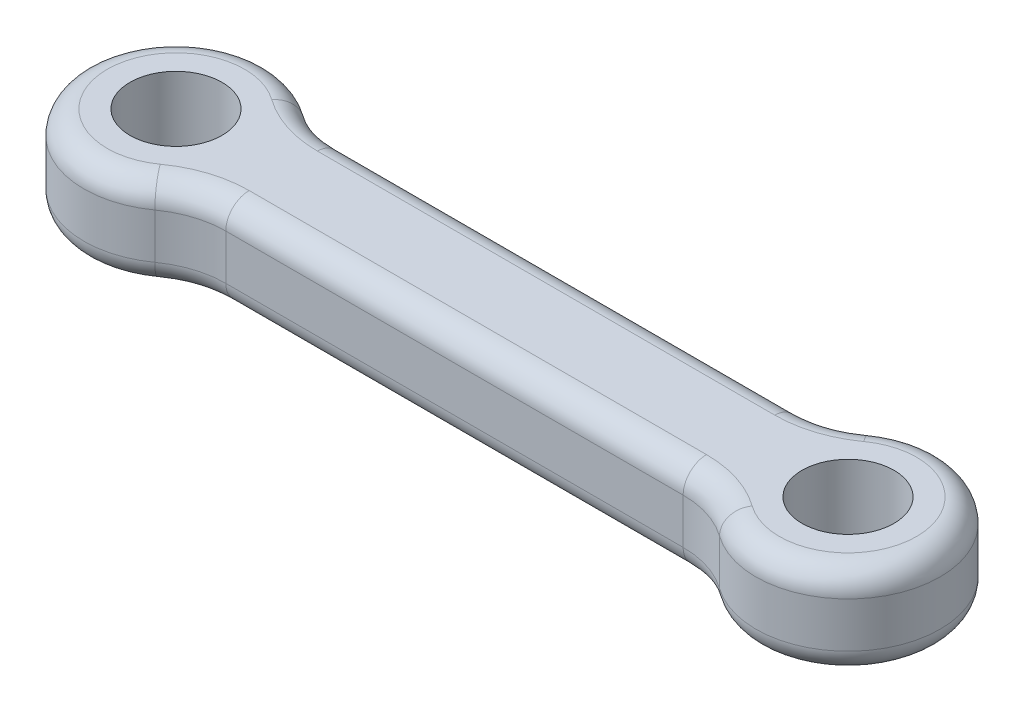
ISO-10303-21;
HEADER;
FILE_DESCRIPTION(('STEP AP214'),'2;1');
FILE_NAME('part.step','',(''),(''),'','','');
FILE_SCHEMA(('AUTOMOTIVE_DESIGN { 1 0 10303 214 1 1 1 1 }'));
ENDSEC;
DATA;
#1=APPLICATION_CONTEXT('core data for automotive mechanical design processes');
#2=APPLICATION_PROTOCOL_DEFINITION('international standard','automotive_design',2000,#1);
#3=PRODUCT_CONTEXT('',#1,'mechanical');
#4=PRODUCT('Part','Part','',(#3));
#5=PRODUCT_RELATED_PRODUCT_CATEGORY('part','',(#4));
#6=PRODUCT_DEFINITION_FORMATION('','',#4);
#7=PRODUCT_DEFINITION_CONTEXT('part definition',#1,'design');
#8=PRODUCT_DEFINITION('design','',#6,#7);
#9=PRODUCT_DEFINITION_SHAPE('','',#8);
#10=(LENGTH_UNIT() NAMED_UNIT(*) SI_UNIT(.MILLI.,.METRE.));
#11=(NAMED_UNIT(*) PLANE_ANGLE_UNIT() SI_UNIT($,.RADIAN.));
#12=(NAMED_UNIT(*) SI_UNIT($,.STERADIAN.) SOLID_ANGLE_UNIT());
#13=UNCERTAINTY_MEASURE_WITH_UNIT(LENGTH_MEASURE(1.E-05),#10,'distance_accuracy_value','');
#14=(GEOMETRIC_REPRESENTATION_CONTEXT(3) GLOBAL_UNCERTAINTY_ASSIGNED_CONTEXT((#13)) GLOBAL_UNIT_ASSIGNED_CONTEXT((#10,
#11,#12)) REPRESENTATION_CONTEXT('',''));
#15=CARTESIAN_POINT('',(0.,0.,0.));
#16=DIRECTION('',(0.,0.,1.));
#17=DIRECTION('',(1.,0.,0.));
#18=AXIS2_PLACEMENT_3D('',#15,#16,#17);
#19=CARTESIAN_POINT('',(-6.59077618363898,10.,-16.25));
#20=DIRECTION('',(0.,1.,0.));
#21=DIRECTION('',(0.,0.,1.));
#22=AXIS2_PLACEMENT_3D('',#19,#20,#21);
#23=PLANE('',#22);
#24=CARTESIAN_POINT('',(43.090776183639,10.,16.25));
#25=DIRECTION('',(0.,1.,0.));
#26=DIRECTION('',(0.,0.,1.));
#27=AXIS2_PLACEMENT_3D('',#24,#25,#26);
#28=CIRCLE('',#27,12.54);
#29=CARTESIAN_POINT('',(43.090776183639,10.,3.71));
#30=VERTEX_POINT('',#29);
#31=CARTESIAN_POINT('',(50.4011095164973,10.,6.06125));
#32=VERTEX_POINT('',#31);
#33=EDGE_CURVE('E267',#30,#32,#28,.F.);
#34=ORIENTED_EDGE('',*,*,#33,.T.);
#35=CARTESIAN_POINT('',(54.75,10.,0.));
#36=DIRECTION('',(0.,1.,0.));
#37=DIRECTION('',(0.,0.,1.));
#38=AXIS2_PLACEMENT_3D('',#35,#36,#37);
#39=CIRCLE('',#38,7.45999999999999);
#40=CARTESIAN_POINT('',(50.4011095164973,10.,-6.06125));
#41=VERTEX_POINT('',#40);
#42=EDGE_CURVE('E154',#32,#41,#39,.T.);
#43=ORIENTED_EDGE('',*,*,#42,.T.);
#44=CARTESIAN_POINT('',(43.090776183639,10.,-16.25));
#45=DIRECTION('',(0.,1.,0.));
#46=DIRECTION('',(0.,0.,1.));
#47=AXIS2_PLACEMENT_3D('',#44,#45,#46);
#48=CIRCLE('',#47,12.54);
#49=CARTESIAN_POINT('',(43.090776183639,10.,-3.71));
#50=VERTEX_POINT('',#49);
#51=EDGE_CURVE('E148',#41,#50,#48,.F.);
#52=ORIENTED_EDGE('',*,*,#51,.T.);
#53=DIRECTION('',(-1.,0.,0.));
#54=VECTOR('',#53,1.);
#55=CARTESIAN_POINT('',(-6.59077618363898,10.,-3.71));
#56=LINE('',#55,#54);
#57=CARTESIAN_POINT('',(-6.59077618363898,10.,-3.71));
#58=VERTEX_POINT('',#57);
#59=EDGE_CURVE('E151',#50,#58,#56,.T.);
#60=ORIENTED_EDGE('',*,*,#59,.T.);
#61=CARTESIAN_POINT('',(-6.59077618363898,10.,-16.25));
#62=DIRECTION('',(0.,1.,0.));
#63=DIRECTION('',(0.,0.,1.));
#64=AXIS2_PLACEMENT_3D('',#61,#62,#63);
#65=CIRCLE('',#64,12.54);
#66=CARTESIAN_POINT('',(-13.9011095164973,10.,-6.06125));
#67=VERTEX_POINT('',#66);
#68=EDGE_CURVE('E158',#58,#67,#65,.F.);
#69=ORIENTED_EDGE('',*,*,#68,.T.);
#70=CARTESIAN_POINT('',(-18.25,10.,0.));
#71=DIRECTION('',(0.,1.,0.));
#72=DIRECTION('',(0.,0.,1.));
#73=AXIS2_PLACEMENT_3D('',#70,#71,#72);
#74=CIRCLE('',#73,7.46);
#75=CARTESIAN_POINT('',(-13.9011095164973,10.,6.06125));
#76=VERTEX_POINT('',#75);
#77=EDGE_CURVE('E273',#67,#76,#74,.T.);
#78=ORIENTED_EDGE('',*,*,#77,.T.);
#79=CARTESIAN_POINT('',(-6.59077618363898,10.,16.25));
#80=DIRECTION('',(0.,1.,0.));
#81=DIRECTION('',(0.,0.,1.));
#82=AXIS2_PLACEMENT_3D('',#79,#80,#81);
#83=CIRCLE('',#82,12.54);
#84=CARTESIAN_POINT('',(-6.59077618363898,10.,3.71));
#85=VERTEX_POINT('',#84);
#86=EDGE_CURVE('E271',#76,#85,#83,.F.);
#87=ORIENTED_EDGE('',*,*,#86,.T.);
#88=DIRECTION('',(1.,0.,0.));
#89=VECTOR('',#88,1.);
#90=CARTESIAN_POINT('',(43.090776183639,10.,3.71));
#91=LINE('',#90,#89);
#92=EDGE_CURVE('E269',#85,#30,#91,.T.);
#93=ORIENTED_EDGE('',*,*,#92,.T.);
#94=EDGE_LOOP('',(#34,#43,#52,#60,#69,#78,#87,#93));
#95=FACE_BOUND('',#94,.T.);
#96=CARTESIAN_POINT('',(-18.25,10.,0.));
#97=DIRECTION('',(0.,1.,0.));
#98=DIRECTION('',(0.,0.,1.));
#99=AXIS2_PLACEMENT_3D('',#96,#97,#98);
#100=CIRCLE('',#99,5.);
#101=CARTESIAN_POINT('',(-18.25,10.,5.));
#102=VERTEX_POINT('',#101);
#103=EDGE_CURVE('E297',#102,#102,#100,.T.);
#104=ORIENTED_EDGE('',*,*,#103,.F.);
#105=EDGE_LOOP('',(#104));
#106=FACE_BOUND('',#105,.T.);
#107=CARTESIAN_POINT('',(54.75,10.,0.));
#108=DIRECTION('',(0.,1.,0.));
#109=DIRECTION('',(0.,0.,-1.));
#110=AXIS2_PLACEMENT_3D('',#107,#108,#109);
#111=CIRCLE('',#110,5.);
#112=CARTESIAN_POINT('',(54.75,10.,-5.));
#113=VERTEX_POINT('',#112);
#114=EDGE_CURVE('E301',#113,#113,#111,.T.);
#115=ORIENTED_EDGE('',*,*,#114,.F.);
#116=EDGE_LOOP('',(#115));
#117=FACE_BOUND('',#116,.T.);
#118=ADVANCED_FACE('F33',(#95,#106,#117),#23,.T.);
#119=CARTESIAN_POINT('',(-6.59077618363898,0.,-16.25));
#120=DIRECTION('',(0.,1.,0.));
#121=DIRECTION('',(0.,0.,1.));
#122=AXIS2_PLACEMENT_3D('',#119,#120,#121);
#123=PLANE('',#122);
#124=CARTESIAN_POINT('',(-6.59077618363898,0.,16.25));
#125=DIRECTION('',(0.,1.,0.));
#126=DIRECTION('',(0.,0.,1.));
#127=AXIS2_PLACEMENT_3D('',#124,#125,#126);
#128=CIRCLE('',#127,12.54);
#129=CARTESIAN_POINT('',(-6.59077618363898,0.,3.71));
#130=VERTEX_POINT('',#129);
#131=CARTESIAN_POINT('',(-13.9011095164973,0.,6.06125));
#132=VERTEX_POINT('',#131);
#133=EDGE_CURVE('E226',#130,#132,#128,.T.);
#134=ORIENTED_EDGE('',*,*,#133,.T.);
#135=CARTESIAN_POINT('',(-18.25,0.,0.));
#136=DIRECTION('',(0.,1.,0.));
#137=DIRECTION('',(0.,0.,1.));
#138=AXIS2_PLACEMENT_3D('',#135,#136,#137);
#139=CIRCLE('',#138,7.46);
#140=CARTESIAN_POINT('',(-13.9011095164973,0.,-6.06125));
#141=VERTEX_POINT('',#140);
#142=EDGE_CURVE('E223',#132,#141,#139,.F.);
#143=ORIENTED_EDGE('',*,*,#142,.T.);
#144=CARTESIAN_POINT('',(-6.59077618363898,0.,-16.25));
#145=DIRECTION('',(0.,1.,0.));
#146=DIRECTION('',(0.,0.,1.));
#147=AXIS2_PLACEMENT_3D('',#144,#145,#146);
#148=CIRCLE('',#147,12.54);
#149=CARTESIAN_POINT('',(-6.59077618363898,0.,-3.71));
#150=VERTEX_POINT('',#149);
#151=EDGE_CURVE('E238',#141,#150,#148,.T.);
#152=ORIENTED_EDGE('',*,*,#151,.T.);
#153=DIRECTION('',(-1.,0.,0.));
#154=VECTOR('',#153,1.);
#155=CARTESIAN_POINT('',(-6.59077618363898,0.,-3.71));
#156=LINE('',#155,#154);
#157=CARTESIAN_POINT('',(43.090776183639,0.,-3.71));
#158=VERTEX_POINT('',#157);
#159=EDGE_CURVE('E236',#150,#158,#156,.F.);
#160=ORIENTED_EDGE('',*,*,#159,.T.);
#161=CARTESIAN_POINT('',(43.090776183639,0.,-16.25));
#162=DIRECTION('',(0.,1.,0.));
#163=DIRECTION('',(0.,0.,1.));
#164=AXIS2_PLACEMENT_3D('',#161,#162,#163);
#165=CIRCLE('',#164,12.54);
#166=CARTESIAN_POINT('',(50.4011095164973,0.,-6.06125));
#167=VERTEX_POINT('',#166);
#168=EDGE_CURVE('E234',#158,#167,#165,.T.);
#169=ORIENTED_EDGE('',*,*,#168,.T.);
#170=CARTESIAN_POINT('',(54.75,0.,0.));
#171=DIRECTION('',(0.,1.,0.));
#172=DIRECTION('',(0.,0.,1.));
#173=AXIS2_PLACEMENT_3D('',#170,#171,#172);
#174=CIRCLE('',#173,7.45999999999999);
#175=CARTESIAN_POINT('',(50.4011095164973,0.,6.06125));
#176=VERTEX_POINT('',#175);
#177=EDGE_CURVE('E232',#167,#176,#174,.F.);
#178=ORIENTED_EDGE('',*,*,#177,.T.);
#179=CARTESIAN_POINT('',(43.090776183639,0.,16.25));
#180=DIRECTION('',(0.,1.,0.));
#181=DIRECTION('',(0.,0.,1.));
#182=AXIS2_PLACEMENT_3D('',#179,#180,#181);
#183=CIRCLE('',#182,12.54);
#184=CARTESIAN_POINT('',(43.090776183639,0.,3.71));
#185=VERTEX_POINT('',#184);
#186=EDGE_CURVE('E230',#176,#185,#183,.T.);
#187=ORIENTED_EDGE('',*,*,#186,.T.);
#188=DIRECTION('',(1.,0.,0.));
#189=VECTOR('',#188,1.);
#190=CARTESIAN_POINT('',(-6.59077618363898,0.,3.71));
#191=LINE('',#190,#189);
#192=EDGE_CURVE('E228',#185,#130,#191,.F.);
#193=ORIENTED_EDGE('',*,*,#192,.T.);
#194=EDGE_LOOP('',(#134,#143,#152,#160,#169,#178,#187,#193));
#195=FACE_BOUND('',#194,.T.);
#196=CARTESIAN_POINT('',(-18.25,0.,0.));
#197=DIRECTION('',(0.,1.,0.));
#198=DIRECTION('',(0.,0.,1.));
#199=AXIS2_PLACEMENT_3D('',#196,#197,#198);
#200=CIRCLE('',#199,5.);
#201=CARTESIAN_POINT('',(-18.25,0.,5.));
#202=VERTEX_POINT('',#201);
#203=EDGE_CURVE('E298',#202,#202,#200,.T.);
#204=ORIENTED_EDGE('',*,*,#203,.T.);
#205=EDGE_LOOP('',(#204));
#206=FACE_BOUND('',#205,.T.);
#207=CARTESIAN_POINT('',(54.75,0.,0.));
#208=DIRECTION('',(0.,1.,0.));
#209=DIRECTION('',(0.,0.,-1.));
#210=AXIS2_PLACEMENT_3D('',#207,#208,#209);
#211=CIRCLE('',#210,5.);
#212=CARTESIAN_POINT('',(54.75,0.,-5.));
#213=VERTEX_POINT('',#212);
#214=EDGE_CURVE('E191',#213,#213,#211,.T.);
#215=ORIENTED_EDGE('',*,*,#214,.T.);
#216=EDGE_LOOP('',(#215));
#217=FACE_BOUND('',#216,.T.);
#218=ADVANCED_FACE('F313',(#195,#206,#217),#123,.F.);
#219=CARTESIAN_POINT('',(-6.59077618363898,10.,-16.25));
#220=DIRECTION('',(0.,-1.,0.));
#221=DIRECTION('',(0.,0.,-1.));
#222=AXIS2_PLACEMENT_3D('',#219,#220,#221);
#223=CYLINDRICAL_SURFACE('',#222,10.);
#224=DIRECTION('',(0.,-1.,0.));
#225=VECTOR('',#224,1.);
#226=CARTESIAN_POINT('',(-12.4203880918195,10.,-8.125));
#227=LINE('',#226,#225);
#228=CARTESIAN_POINT('',(-12.4203880918195,7.46,-8.125));
#229=VERTEX_POINT('',#228);
#230=CARTESIAN_POINT('',(-12.4203880918195,2.54,-8.125));
#231=VERTEX_POINT('',#230);
#232=EDGE_CURVE('E168',#229,#231,#227,.T.);
#233=ORIENTED_EDGE('',*,*,#232,.F.);
#234=CARTESIAN_POINT('',(-6.59077618363898,7.46,-16.25));
#235=DIRECTION('',(0.,1.,0.));
#236=DIRECTION('',(0.,0.,1.));
#237=AXIS2_PLACEMENT_3D('',#234,#235,#236);
#238=CIRCLE('',#237,10.);
#239=CARTESIAN_POINT('',(-6.59077618363898,7.46,-6.25));
#240=VERTEX_POINT('',#239);
#241=EDGE_CURVE('E240',#229,#240,#238,.T.);
#242=ORIENTED_EDGE('',*,*,#241,.T.);
#243=DIRECTION('',(0.,-1.,0.));
#244=VECTOR('',#243,1.);
#245=CARTESIAN_POINT('',(-6.59077618363898,10.,-6.25));
#246=LINE('',#245,#244);
#247=CARTESIAN_POINT('',(-6.59077618363898,2.54,-6.25));
#248=VERTEX_POINT('',#247);
#249=EDGE_CURVE('E294',#240,#248,#246,.T.);
#250=ORIENTED_EDGE('',*,*,#249,.T.);
#251=CARTESIAN_POINT('',(-6.59077618363898,2.54,-16.25));
#252=DIRECTION('',(0.,1.,0.));
#253=DIRECTION('',(0.,0.,1.));
#254=AXIS2_PLACEMENT_3D('',#251,#252,#253);
#255=CIRCLE('',#254,10.);
#256=EDGE_CURVE('E242',#248,#231,#255,.F.);
#257=ORIENTED_EDGE('',*,*,#256,.T.);
#258=EDGE_LOOP('',(#233,#242,#250,#257));
#259=FACE_BOUND('',#258,.T.);
#260=ADVANCED_FACE('F318',(#259),#223,.F.);
#261=CARTESIAN_POINT('',(-18.25,10.,0.));
#262=DIRECTION('',(0.,-1.,0.));
#263=DIRECTION('',(0.,0.,-1.));
#264=AXIS2_PLACEMENT_3D('',#261,#262,#263);
#265=CYLINDRICAL_SURFACE('',#264,10.);
#266=DIRECTION('',(0.,-1.,0.));
#267=VECTOR('',#266,1.);
#268=CARTESIAN_POINT('',(-12.4203880918195,10.,8.125));
#269=LINE('',#268,#267);
#270=CARTESIAN_POINT('',(-12.4203880918195,7.46,8.125));
#271=VERTEX_POINT('',#270);
#272=CARTESIAN_POINT('',(-12.4203880918195,2.54,8.125));
#273=VERTEX_POINT('',#272);
#274=EDGE_CURVE('E278',#271,#273,#269,.T.);
#275=ORIENTED_EDGE('',*,*,#274,.F.);
#276=CARTESIAN_POINT('',(-18.25,7.46,0.));
#277=DIRECTION('',(0.,1.,0.));
#278=DIRECTION('',(0.,0.,1.));
#279=AXIS2_PLACEMENT_3D('',#276,#277,#278);
#280=CIRCLE('',#279,10.);
#281=EDGE_CURVE('E244',#271,#229,#280,.F.);
#282=ORIENTED_EDGE('',*,*,#281,.T.);
#283=ORIENTED_EDGE('',*,*,#232,.T.);
#284=CARTESIAN_POINT('',(-18.25,2.54,0.));
#285=DIRECTION('',(0.,1.,0.));
#286=DIRECTION('',(0.,0.,1.));
#287=AXIS2_PLACEMENT_3D('',#284,#285,#286);
#288=CIRCLE('',#287,10.);
#289=EDGE_CURVE('E246',#231,#273,#288,.T.);
#290=ORIENTED_EDGE('',*,*,#289,.T.);
#291=EDGE_LOOP('',(#275,#282,#283,#290));
#292=FACE_BOUND('',#291,.T.);
#293=ADVANCED_FACE('F346',(#292),#265,.T.);
#294=CARTESIAN_POINT('',(-6.59077618363898,10.,16.25));
#295=DIRECTION('',(0.,-1.,0.));
#296=DIRECTION('',(0.,0.,-1.));
#297=AXIS2_PLACEMENT_3D('',#294,#295,#296);
#298=CYLINDRICAL_SURFACE('',#297,10.);
#299=DIRECTION('',(0.,-1.,0.));
#300=VECTOR('',#299,1.);
#301=CARTESIAN_POINT('',(-6.59077618363898,10.,6.25));
#302=LINE('',#301,#300);
#303=CARTESIAN_POINT('',(-6.59077618363898,7.46,6.25));
#304=VERTEX_POINT('',#303);
#305=CARTESIAN_POINT('',(-6.59077618363898,2.54,6.25));
#306=VERTEX_POINT('',#305);
#307=EDGE_CURVE('E281',#304,#306,#302,.T.);
#308=ORIENTED_EDGE('',*,*,#307,.F.);
#309=CARTESIAN_POINT('',(-6.59077618363898,7.46,16.25));
#310=DIRECTION('',(0.,1.,0.));
#311=DIRECTION('',(0.,0.,1.));
#312=AXIS2_PLACEMENT_3D('',#309,#310,#311);
#313=CIRCLE('',#312,10.);
#314=EDGE_CURVE('E249',#304,#271,#313,.T.);
#315=ORIENTED_EDGE('',*,*,#314,.T.);
#316=ORIENTED_EDGE('',*,*,#274,.T.);
#317=CARTESIAN_POINT('',(-6.59077618363898,2.54,16.25));
#318=DIRECTION('',(0.,1.,0.));
#319=DIRECTION('',(0.,0.,1.));
#320=AXIS2_PLACEMENT_3D('',#317,#318,#319);
#321=CIRCLE('',#320,10.);
#322=EDGE_CURVE('E251',#273,#306,#321,.F.);
#323=ORIENTED_EDGE('',*,*,#322,.T.);
#324=EDGE_LOOP('',(#308,#315,#316,#323));
#325=FACE_BOUND('',#324,.T.);
#326=ADVANCED_FACE('F342',(#325),#298,.F.);
#327=CARTESIAN_POINT('',(-6.59077618363898,10.,6.25));
#328=DIRECTION('',(0.,0.,-1.));
#329=DIRECTION('',(-1.,0.,0.));
#330=AXIS2_PLACEMENT_3D('',#327,#328,#329);
#331=PLANE('',#330);
#332=DIRECTION('',(0.,-1.,0.));
#333=VECTOR('',#332,1.);
#334=CARTESIAN_POINT('',(43.090776183639,10.,6.25));
#335=LINE('',#334,#333);
#336=CARTESIAN_POINT('',(43.090776183639,7.46,6.25));
#337=VERTEX_POINT('',#336);
#338=CARTESIAN_POINT('',(43.090776183639,2.54,6.25));
#339=VERTEX_POINT('',#338);
#340=EDGE_CURVE('E284',#337,#339,#335,.T.);
#341=ORIENTED_EDGE('',*,*,#340,.F.);
#342=DIRECTION('',(1.,0.,0.));
#343=VECTOR('',#342,1.);
#344=CARTESIAN_POINT('',(-6.59077618363898,7.46,6.25));
#345=LINE('',#344,#343);
#346=EDGE_CURVE('E253',#337,#304,#345,.F.);
#347=ORIENTED_EDGE('',*,*,#346,.T.);
#348=ORIENTED_EDGE('',*,*,#307,.T.);
#349=DIRECTION('',(1.,0.,0.));
#350=VECTOR('',#349,1.);
#351=CARTESIAN_POINT('',(-6.59077618363898,2.54,6.25));
#352=LINE('',#351,#350);
#353=EDGE_CURVE('E255',#306,#339,#352,.T.);
#354=ORIENTED_EDGE('',*,*,#353,.T.);
#355=EDGE_LOOP('',(#341,#347,#348,#354));
#356=FACE_BOUND('',#355,.T.);
#357=ADVANCED_FACE('F338',(#356),#331,.F.);
#358=CARTESIAN_POINT('',(43.090776183639,10.,16.25));
#359=DIRECTION('',(0.,-1.,0.));
#360=DIRECTION('',(0.,0.,-1.));
#361=AXIS2_PLACEMENT_3D('',#358,#359,#360);
#362=CYLINDRICAL_SURFACE('',#361,10.);
#363=DIRECTION('',(0.,-1.,0.));
#364=VECTOR('',#363,1.);
#365=CARTESIAN_POINT('',(48.9203880918195,10.,8.125));
#366=LINE('',#365,#364);
#367=CARTESIAN_POINT('',(48.9203880918195,7.46,8.125));
#368=VERTEX_POINT('',#367);
#369=CARTESIAN_POINT('',(48.9203880918195,2.54,8.125));
#370=VERTEX_POINT('',#369);
#371=EDGE_CURVE('E287',#368,#370,#366,.T.);
#372=ORIENTED_EDGE('',*,*,#371,.F.);
#373=CARTESIAN_POINT('',(43.090776183639,7.46,16.25));
#374=DIRECTION('',(0.,1.,0.));
#375=DIRECTION('',(0.,0.,1.));
#376=AXIS2_PLACEMENT_3D('',#373,#374,#375);
#377=CIRCLE('',#376,10.);
#378=EDGE_CURVE('E257',#368,#337,#377,.T.);
#379=ORIENTED_EDGE('',*,*,#378,.T.);
#380=ORIENTED_EDGE('',*,*,#340,.T.);
#381=CARTESIAN_POINT('',(43.090776183639,2.54,16.25));
#382=DIRECTION('',(0.,1.,0.));
#383=DIRECTION('',(0.,0.,1.));
#384=AXIS2_PLACEMENT_3D('',#381,#382,#383);
#385=CIRCLE('',#384,10.);
#386=EDGE_CURVE('E259',#339,#370,#385,.F.);
#387=ORIENTED_EDGE('',*,*,#386,.T.);
#388=EDGE_LOOP('',(#372,#379,#380,#387));
#389=FACE_BOUND('',#388,.T.);
#390=ADVANCED_FACE('F334',(#389),#362,.F.);
#391=CARTESIAN_POINT('',(54.75,10.,0.));
#392=DIRECTION('',(0.,-1.,0.));
#393=DIRECTION('',(0.,0.,-1.));
#394=AXIS2_PLACEMENT_3D('',#391,#392,#393);
#395=CYLINDRICAL_SURFACE('',#394,9.99999999999999);
#396=DIRECTION('',(0.,-1.,0.));
#397=VECTOR('',#396,1.);
#398=CARTESIAN_POINT('',(48.9203880918195,10.,-8.125));
#399=LINE('',#398,#397);
#400=CARTESIAN_POINT('',(48.9203880918195,7.46,-8.125));
#401=VERTEX_POINT('',#400);
#402=CARTESIAN_POINT('',(48.9203880918195,2.54,-8.125));
#403=VERTEX_POINT('',#402);
#404=EDGE_CURVE('E290',#401,#403,#399,.T.);
#405=ORIENTED_EDGE('',*,*,#404,.F.);
#406=CARTESIAN_POINT('',(54.75,7.46,0.));
#407=DIRECTION('',(0.,1.,0.));
#408=DIRECTION('',(0.,0.,1.));
#409=AXIS2_PLACEMENT_3D('',#406,#407,#408);
#410=CIRCLE('',#409,9.99999999999999);
#411=EDGE_CURVE('E261',#401,#368,#410,.F.);
#412=ORIENTED_EDGE('',*,*,#411,.T.);
#413=ORIENTED_EDGE('',*,*,#371,.T.);
#414=CARTESIAN_POINT('',(54.75,2.54,0.));
#415=DIRECTION('',(0.,1.,0.));
#416=DIRECTION('',(0.,0.,1.));
#417=AXIS2_PLACEMENT_3D('',#414,#415,#416);
#418=CIRCLE('',#417,9.99999999999999);
#419=EDGE_CURVE('E264',#370,#403,#418,.T.);
#420=ORIENTED_EDGE('',*,*,#419,.T.);
#421=EDGE_LOOP('',(#405,#412,#413,#420));
#422=FACE_BOUND('',#421,.T.);
#423=ADVANCED_FACE('F331',(#422),#395,.T.);
#424=CARTESIAN_POINT('',(43.090776183639,10.,-16.25));
#425=DIRECTION('',(0.,-1.,0.));
#426=DIRECTION('',(0.,0.,-1.));
#427=AXIS2_PLACEMENT_3D('',#424,#425,#426);
#428=CYLINDRICAL_SURFACE('',#427,10.);
#429=ORIENTED_EDGE('',*,*,#404,.T.);
#430=CARTESIAN_POINT('',(43.090776183639,2.54,-16.25));
#431=DIRECTION('',(0.,1.,0.));
#432=DIRECTION('',(0.,0.,1.));
#433=AXIS2_PLACEMENT_3D('',#430,#431,#432);
#434=CIRCLE('',#433,10.);
#435=CARTESIAN_POINT('',(43.090776183639,2.54,-6.25));
#436=VERTEX_POINT('',#435);
#437=EDGE_CURVE('E50',#403,#436,#434,.F.);
#438=ORIENTED_EDGE('',*,*,#437,.T.);
#439=DIRECTION('',(0.,-1.,0.));
#440=VECTOR('',#439,1.);
#441=CARTESIAN_POINT('',(43.090776183639,10.,-6.25));
#442=LINE('',#441,#440);
#443=CARTESIAN_POINT('',(43.090776183639,7.46,-6.25));
#444=VERTEX_POINT('',#443);
#445=EDGE_CURVE('E292',#444,#436,#442,.T.);
#446=ORIENTED_EDGE('',*,*,#445,.F.);
#447=CARTESIAN_POINT('',(43.090776183639,7.46,-16.25));
#448=DIRECTION('',(0.,1.,0.));
#449=DIRECTION('',(0.,0.,1.));
#450=AXIS2_PLACEMENT_3D('',#447,#448,#449);
#451=CIRCLE('',#450,10.);
#452=EDGE_CURVE('E171',#444,#401,#451,.T.);
#453=ORIENTED_EDGE('',*,*,#452,.T.);
#454=EDGE_LOOP('',(#429,#438,#446,#453));
#455=FACE_BOUND('',#454,.T.);
#456=ADVANCED_FACE('F328',(#455),#428,.F.);
#457=CARTESIAN_POINT('',(-6.59077618363898,10.,-6.25));
#458=DIRECTION('',(0.,0.,1.));
#459=DIRECTION('',(1.,0.,0.));
#460=AXIS2_PLACEMENT_3D('',#457,#458,#459);
#461=PLANE('',#460);
#462=ORIENTED_EDGE('',*,*,#445,.T.);
#463=DIRECTION('',(-1.,0.,0.));
#464=VECTOR('',#463,1.);
#465=CARTESIAN_POINT('',(-6.59077618363898,2.54,-6.25));
#466=LINE('',#465,#464);
#467=EDGE_CURVE('E11',#436,#248,#466,.T.);
#468=ORIENTED_EDGE('',*,*,#467,.T.);
#469=ORIENTED_EDGE('',*,*,#249,.F.);
#470=DIRECTION('',(-1.,0.,0.));
#471=VECTOR('',#470,1.);
#472=CARTESIAN_POINT('',(43.090776183639,7.46,-6.25));
#473=LINE('',#472,#471);
#474=EDGE_CURVE('E42',#240,#444,#473,.F.);
#475=ORIENTED_EDGE('',*,*,#474,.T.);
#476=EDGE_LOOP('',(#462,#468,#469,#475));
#477=FACE_BOUND('',#476,.T.);
#478=ADVANCED_FACE('F325',(#477),#461,.F.);
#479=CARTESIAN_POINT('',(-18.25,10.,0.));
#480=DIRECTION('',(0.,-1.,0.));
#481=DIRECTION('',(0.,0.,-1.));
#482=AXIS2_PLACEMENT_3D('',#479,#480,#481);
#483=CYLINDRICAL_SURFACE('',#482,5.);
#484=ORIENTED_EDGE('',*,*,#103,.T.);
#485=EDGE_LOOP('',(#484));
#486=FACE_BOUND('',#485,.T.);
#487=ORIENTED_EDGE('',*,*,#203,.F.);
#488=EDGE_LOOP('',(#487));
#489=FACE_BOUND('',#488,.T.);
#490=ADVANCED_FACE('F322',(#486,#489),#483,.F.);
#491=CARTESIAN_POINT('',(54.75,10.,0.));
#492=DIRECTION('',(0.,-1.,0.));
#493=DIRECTION('',(0.,0.,-1.));
#494=AXIS2_PLACEMENT_3D('',#491,#492,#493);
#495=CYLINDRICAL_SURFACE('',#494,5.);
#496=ORIENTED_EDGE('',*,*,#114,.T.);
#497=EDGE_LOOP('',(#496));
#498=FACE_BOUND('',#497,.T.);
#499=ORIENTED_EDGE('',*,*,#214,.F.);
#500=EDGE_LOOP('',(#499));
#501=FACE_BOUND('',#500,.T.);
#502=ADVANCED_FACE('F309',(#498,#501),#495,.F.);
#503=CARTESIAN_POINT('',(-18.25,7.46,0.));
#504=DIRECTION('',(0.,1.,0.));
#505=DIRECTION('',(0.,0.,1.));
#506=AXIS2_PLACEMENT_3D('',#503,#504,#505);
#507=TOROIDAL_SURFACE('',#506,7.46,2.54);
#508=CARTESIAN_POINT('',(-13.9011095164973,7.46,-6.06125));
#509=DIRECTION('',(0.8125,0.,0.582961190818051));
#510=DIRECTION('',(0.582961190818051,0.,-0.8125));
#511=AXIS2_PLACEMENT_3D('',#508,#509,#510);
#512=CIRCLE('',#511,2.54);
#513=EDGE_CURVE('E185',#229,#67,#512,.T.);
#514=ORIENTED_EDGE('',*,*,#513,.F.);
#515=ORIENTED_EDGE('',*,*,#281,.F.);
#516=CARTESIAN_POINT('',(-13.9011095164973,7.46,6.06125));
#517=DIRECTION('',(0.8125,0.,-0.582961190818051));
#518=DIRECTION('',(-0.582961190818051,0.,-0.8125));
#519=AXIS2_PLACEMENT_3D('',#516,#517,#518);
#520=CIRCLE('',#519,2.54);
#521=EDGE_CURVE('E188',#76,#271,#520,.T.);
#522=ORIENTED_EDGE('',*,*,#521,.F.);
#523=ORIENTED_EDGE('',*,*,#77,.F.);
#524=EDGE_LOOP('',(#514,#515,#522,#523));
#525=FACE_BOUND('',#524,.T.);
#526=ADVANCED_FACE('F376',(#525),#507,.T.);
#527=CARTESIAN_POINT('',(-6.59077618363898,7.46,16.25));
#528=DIRECTION('',(0.,1.,0.));
#529=DIRECTION('',(0.,0.,1.));
#530=AXIS2_PLACEMENT_3D('',#527,#528,#529);
#531=TOROIDAL_SURFACE('',#530,12.54,2.54);
#532=ORIENTED_EDGE('',*,*,#521,.T.);
#533=ORIENTED_EDGE('',*,*,#314,.F.);
#534=CARTESIAN_POINT('',(-6.59077618363898,7.46,3.71));
#535=DIRECTION('',(1.,0.,0.));
#536=DIRECTION('',(0.,0.,-1.));
#537=AXIS2_PLACEMENT_3D('',#534,#535,#536);
#538=CIRCLE('',#537,2.54);
#539=EDGE_CURVE('E182',#85,#304,#538,.T.);
#540=ORIENTED_EDGE('',*,*,#539,.F.);
#541=ORIENTED_EDGE('',*,*,#86,.F.);
#542=EDGE_LOOP('',(#532,#533,#540,#541));
#543=FACE_BOUND('',#542,.T.);
#544=ADVANCED_FACE('F372',(#543),#531,.T.);
#545=CARTESIAN_POINT('',(-6.59077618363898,7.46,-16.25));
#546=DIRECTION('',(0.,1.,0.));
#547=DIRECTION('',(0.,0.,1.));
#548=AXIS2_PLACEMENT_3D('',#545,#546,#547);
#549=TOROIDAL_SURFACE('',#548,12.54,2.54);
#550=ORIENTED_EDGE('',*,*,#513,.T.);
#551=ORIENTED_EDGE('',*,*,#68,.F.);
#552=CARTESIAN_POINT('',(-6.59077618363898,7.46,-3.71));
#553=DIRECTION('',(1.,0.,0.));
#554=DIRECTION('',(0.,0.,-1.));
#555=AXIS2_PLACEMENT_3D('',#552,#553,#554);
#556=CIRCLE('',#555,2.54);
#557=EDGE_CURVE('E167',#240,#58,#556,.T.);
#558=ORIENTED_EDGE('',*,*,#557,.F.);
#559=ORIENTED_EDGE('',*,*,#241,.F.);
#560=EDGE_LOOP('',(#550,#551,#558,#559));
#561=FACE_BOUND('',#560,.T.);
#562=ADVANCED_FACE('F368',(#561),#549,.T.);
#563=CARTESIAN_POINT('',(-6.59077618363898,7.46,3.71));
#564=DIRECTION('',(-1.,0.,0.));
#565=DIRECTION('',(0.,0.,1.));
#566=AXIS2_PLACEMENT_3D('',#563,#564,#565);
#567=CYLINDRICAL_SURFACE('',#566,2.54);
#568=ORIENTED_EDGE('',*,*,#539,.T.);
#569=ORIENTED_EDGE('',*,*,#346,.F.);
#570=CARTESIAN_POINT('',(43.090776183639,7.46,3.71));
#571=DIRECTION('',(1.,0.,0.));
#572=DIRECTION('',(0.,0.,-1.));
#573=AXIS2_PLACEMENT_3D('',#570,#571,#572);
#574=CIRCLE('',#573,2.54);
#575=EDGE_CURVE('E172',#30,#337,#574,.T.);
#576=ORIENTED_EDGE('',*,*,#575,.F.);
#577=ORIENTED_EDGE('',*,*,#92,.F.);
#578=EDGE_LOOP('',(#568,#569,#576,#577));
#579=FACE_BOUND('',#578,.T.);
#580=ADVANCED_FACE('F365',(#579),#567,.T.);
#581=CARTESIAN_POINT('',(-6.59077618363898,7.46,-3.71));
#582=DIRECTION('',(1.,0.,0.));
#583=DIRECTION('',(0.,0.,-1.));
#584=AXIS2_PLACEMENT_3D('',#581,#582,#583);
#585=CYLINDRICAL_SURFACE('',#584,2.54);
#586=ORIENTED_EDGE('',*,*,#557,.T.);
#587=ORIENTED_EDGE('',*,*,#59,.F.);
#588=CARTESIAN_POINT('',(43.090776183639,7.46,-3.71));
#589=DIRECTION('',(1.,0.,0.));
#590=DIRECTION('',(0.,0.,-1.));
#591=AXIS2_PLACEMENT_3D('',#588,#589,#590);
#592=CIRCLE('',#591,2.54);
#593=EDGE_CURVE('E164',#444,#50,#592,.T.);
#594=ORIENTED_EDGE('',*,*,#593,.F.);
#595=ORIENTED_EDGE('',*,*,#474,.F.);
#596=EDGE_LOOP('',(#586,#587,#594,#595));
#597=FACE_BOUND('',#596,.T.);
#598=ADVANCED_FACE('F163',(#597),#585,.T.);
#599=CARTESIAN_POINT('',(43.090776183639,7.46,16.25));
#600=DIRECTION('',(0.,1.,0.));
#601=DIRECTION('',(0.,0.,1.));
#602=AXIS2_PLACEMENT_3D('',#599,#600,#601);
#603=TOROIDAL_SURFACE('',#602,12.54,2.54);
#604=ORIENTED_EDGE('',*,*,#575,.T.);
#605=ORIENTED_EDGE('',*,*,#378,.F.);
#606=CARTESIAN_POINT('',(50.4011095164973,7.46,6.06125));
#607=DIRECTION('',(0.812500000000001,0.,0.582961190818049));
#608=DIRECTION('',(0.582961190818049,0.,-0.812500000000001));
#609=AXIS2_PLACEMENT_3D('',#606,#607,#608);
#610=CIRCLE('',#609,2.54);
#611=EDGE_CURVE('E173',#32,#368,#610,.T.);
#612=ORIENTED_EDGE('',*,*,#611,.F.);
#613=ORIENTED_EDGE('',*,*,#33,.F.);
#614=EDGE_LOOP('',(#604,#605,#612,#613));
#615=FACE_BOUND('',#614,.T.);
#616=ADVANCED_FACE('F359',(#615),#603,.T.);
#617=CARTESIAN_POINT('',(43.090776183639,7.46,-16.25));
#618=DIRECTION('',(0.,1.,0.));
#619=DIRECTION('',(0.,0.,1.));
#620=AXIS2_PLACEMENT_3D('',#617,#618,#619);
#621=TOROIDAL_SURFACE('',#620,12.54,2.54);
#622=ORIENTED_EDGE('',*,*,#593,.T.);
#623=ORIENTED_EDGE('',*,*,#51,.F.);
#624=CARTESIAN_POINT('',(50.4011095164973,7.46,-6.06125));
#625=DIRECTION('',(0.812500000000001,0.,-0.58296119081805));
#626=DIRECTION('',(-0.58296119081805,0.,-0.812500000000001));
#627=AXIS2_PLACEMENT_3D('',#624,#625,#626);
#628=CIRCLE('',#627,2.54);
#629=EDGE_CURVE('E177',#401,#41,#628,.T.);
#630=ORIENTED_EDGE('',*,*,#629,.F.);
#631=ORIENTED_EDGE('',*,*,#452,.F.);
#632=EDGE_LOOP('',(#622,#623,#630,#631));
#633=FACE_BOUND('',#632,.T.);
#634=ADVANCED_FACE('F170',(#633),#621,.T.);
#635=CARTESIAN_POINT('',(54.75,7.46,0.));
#636=DIRECTION('',(0.,1.,0.));
#637=DIRECTION('',(0.,0.,1.));
#638=AXIS2_PLACEMENT_3D('',#635,#636,#637);
#639=TOROIDAL_SURFACE('',#638,7.45999999999999,2.54);
#640=ORIENTED_EDGE('',*,*,#611,.T.);
#641=ORIENTED_EDGE('',*,*,#411,.F.);
#642=ORIENTED_EDGE('',*,*,#629,.T.);
#643=ORIENTED_EDGE('',*,*,#42,.F.);
#644=EDGE_LOOP('',(#640,#641,#642,#643));
#645=FACE_BOUND('',#644,.T.);
#646=ADVANCED_FACE('F354',(#645),#639,.T.);
#647=CARTESIAN_POINT('',(54.75,2.54,0.));
#648=DIRECTION('',(0.,1.,0.));
#649=DIRECTION('',(0.,0.,1.));
#650=AXIS2_PLACEMENT_3D('',#647,#648,#649);
#651=TOROIDAL_SURFACE('',#650,7.45999999999999,2.54);
#652=CARTESIAN_POINT('',(50.4011095164973,2.54,6.06125));
#653=DIRECTION('',(-0.812499999999999,0.,-0.582961190818052));
#654=DIRECTION('',(-0.582961190818052,0.,0.812499999999999));
#655=AXIS2_PLACEMENT_3D('',#652,#653,#654);
#656=CIRCLE('',#655,2.54);
#657=EDGE_CURVE('E207',#176,#370,#656,.T.);
#658=ORIENTED_EDGE('',*,*,#657,.F.);
#659=ORIENTED_EDGE('',*,*,#177,.F.);
#660=CARTESIAN_POINT('',(50.4011095164973,2.54,-6.06125));
#661=DIRECTION('',(-0.812499999999999,0.,0.582961190818052));
#662=DIRECTION('',(0.582961190818052,0.,0.812499999999999));
#663=AXIS2_PLACEMENT_3D('',#660,#661,#662);
#664=CIRCLE('',#663,2.54);
#665=EDGE_CURVE('E37',#403,#167,#664,.T.);
#666=ORIENTED_EDGE('',*,*,#665,.F.);
#667=ORIENTED_EDGE('',*,*,#419,.F.);
#668=EDGE_LOOP('',(#658,#659,#666,#667));
#669=FACE_BOUND('',#668,.T.);
#670=ADVANCED_FACE('F35',(#669),#651,.T.);
#671=CARTESIAN_POINT('',(43.090776183639,2.54,-16.25));
#672=DIRECTION('',(0.,1.,0.));
#673=DIRECTION('',(0.,0.,1.));
#674=AXIS2_PLACEMENT_3D('',#671,#672,#673);
#675=TOROIDAL_SURFACE('',#674,12.54,2.54);
#676=ORIENTED_EDGE('',*,*,#665,.T.);
#677=ORIENTED_EDGE('',*,*,#168,.F.);
#678=CARTESIAN_POINT('',(43.090776183639,2.54,-3.71));
#679=DIRECTION('',(-1.,0.,0.));
#680=DIRECTION('',(0.,0.,1.));
#681=AXIS2_PLACEMENT_3D('',#678,#679,#680);
#682=CIRCLE('',#681,2.54);
#683=EDGE_CURVE('E205',#436,#158,#682,.T.);
#684=ORIENTED_EDGE('',*,*,#683,.F.);
#685=ORIENTED_EDGE('',*,*,#437,.F.);
#686=EDGE_LOOP('',(#676,#677,#684,#685));
#687=FACE_BOUND('',#686,.T.);
#688=ADVANCED_FACE('F403',(#687),#675,.T.);
#689=CARTESIAN_POINT('',(43.090776183639,2.54,16.25));
#690=DIRECTION('',(0.,1.,0.));
#691=DIRECTION('',(0.,0.,1.));
#692=AXIS2_PLACEMENT_3D('',#689,#690,#691);
#693=TOROIDAL_SURFACE('',#692,12.54,2.54);
#694=ORIENTED_EDGE('',*,*,#657,.T.);
#695=ORIENTED_EDGE('',*,*,#386,.F.);
#696=CARTESIAN_POINT('',(43.090776183639,2.54,3.71));
#697=DIRECTION('',(-1.,0.,0.));
#698=DIRECTION('',(0.,0.,1.));
#699=AXIS2_PLACEMENT_3D('',#696,#697,#698);
#700=CIRCLE('',#699,2.54);
#701=EDGE_CURVE('E202',#185,#339,#700,.T.);
#702=ORIENTED_EDGE('',*,*,#701,.F.);
#703=ORIENTED_EDGE('',*,*,#186,.F.);
#704=EDGE_LOOP('',(#694,#695,#702,#703));
#705=FACE_BOUND('',#704,.T.);
#706=ADVANCED_FACE('F400',(#705),#693,.T.);
#707=CARTESIAN_POINT('',(-6.59077618363898,2.54,-3.71));
#708=DIRECTION('',(-1.,0.,0.));
#709=DIRECTION('',(0.,0.,1.));
#710=AXIS2_PLACEMENT_3D('',#707,#708,#709);
#711=CYLINDRICAL_SURFACE('',#710,2.54);
#712=ORIENTED_EDGE('',*,*,#683,.T.);
#713=ORIENTED_EDGE('',*,*,#159,.F.);
#714=CARTESIAN_POINT('',(-6.59077618363898,2.54,-3.71));
#715=DIRECTION('',(-1.,0.,0.));
#716=DIRECTION('',(0.,0.,1.));
#717=AXIS2_PLACEMENT_3D('',#714,#715,#716);
#718=CIRCLE('',#717,2.54);
#719=EDGE_CURVE('E199',#248,#150,#718,.T.);
#720=ORIENTED_EDGE('',*,*,#719,.F.);
#721=ORIENTED_EDGE('',*,*,#467,.F.);
#722=EDGE_LOOP('',(#712,#713,#720,#721));
#723=FACE_BOUND('',#722,.T.);
#724=ADVANCED_FACE('F396',(#723),#711,.T.);
#725=CARTESIAN_POINT('',(-6.59077618363898,2.54,3.71));
#726=DIRECTION('',(1.,0.,0.));
#727=DIRECTION('',(0.,0.,-1.));
#728=AXIS2_PLACEMENT_3D('',#725,#726,#727);
#729=CYLINDRICAL_SURFACE('',#728,2.54);
#730=ORIENTED_EDGE('',*,*,#701,.T.);
#731=ORIENTED_EDGE('',*,*,#353,.F.);
#732=CARTESIAN_POINT('',(-6.59077618363898,2.54,3.71));
#733=DIRECTION('',(-1.,0.,0.));
#734=DIRECTION('',(0.,0.,1.));
#735=AXIS2_PLACEMENT_3D('',#732,#733,#734);
#736=CIRCLE('',#735,2.54);
#737=EDGE_CURVE('E196',#130,#306,#736,.T.);
#738=ORIENTED_EDGE('',*,*,#737,.F.);
#739=ORIENTED_EDGE('',*,*,#192,.F.);
#740=EDGE_LOOP('',(#730,#731,#738,#739));
#741=FACE_BOUND('',#740,.T.);
#742=ADVANCED_FACE('F392',(#741),#729,.T.);
#743=CARTESIAN_POINT('',(-6.59077618363898,2.54,-16.25));
#744=DIRECTION('',(0.,1.,0.));
#745=DIRECTION('',(0.,0.,1.));
#746=AXIS2_PLACEMENT_3D('',#743,#744,#745);
#747=TOROIDAL_SURFACE('',#746,12.54,2.54);
#748=ORIENTED_EDGE('',*,*,#719,.T.);
#749=ORIENTED_EDGE('',*,*,#151,.F.);
#750=CARTESIAN_POINT('',(-13.9011095164973,2.54,-6.06125));
#751=DIRECTION('',(-0.8125,0.,-0.582961190818051));
#752=DIRECTION('',(-0.582961190818051,0.,0.8125));
#753=AXIS2_PLACEMENT_3D('',#750,#751,#752);
#754=CIRCLE('',#753,2.54);
#755=EDGE_CURVE('E194',#231,#141,#754,.T.);
#756=ORIENTED_EDGE('',*,*,#755,.F.);
#757=ORIENTED_EDGE('',*,*,#256,.F.);
#758=EDGE_LOOP('',(#748,#749,#756,#757));
#759=FACE_BOUND('',#758,.T.);
#760=ADVANCED_FACE('F388',(#759),#747,.T.);
#761=CARTESIAN_POINT('',(-6.59077618363898,2.54,16.25));
#762=DIRECTION('',(0.,1.,0.));
#763=DIRECTION('',(0.,0.,1.));
#764=AXIS2_PLACEMENT_3D('',#761,#762,#763);
#765=TOROIDAL_SURFACE('',#764,12.54,2.54);
#766=ORIENTED_EDGE('',*,*,#737,.T.);
#767=ORIENTED_EDGE('',*,*,#322,.F.);
#768=CARTESIAN_POINT('',(-13.9011095164973,2.54,6.06125));
#769=DIRECTION('',(-0.8125,0.,0.582961190818051));
#770=DIRECTION('',(0.582961190818051,0.,0.8125));
#771=AXIS2_PLACEMENT_3D('',#768,#769,#770);
#772=CIRCLE('',#771,2.54);
#773=EDGE_CURVE('E192',#132,#273,#772,.T.);
#774=ORIENTED_EDGE('',*,*,#773,.F.);
#775=ORIENTED_EDGE('',*,*,#133,.F.);
#776=EDGE_LOOP('',(#766,#767,#774,#775));
#777=FACE_BOUND('',#776,.T.);
#778=ADVANCED_FACE('F384',(#777),#765,.T.);
#779=CARTESIAN_POINT('',(-18.25,2.54,0.));
#780=DIRECTION('',(0.,1.,0.));
#781=DIRECTION('',(0.,0.,1.));
#782=AXIS2_PLACEMENT_3D('',#779,#780,#781);
#783=TOROIDAL_SURFACE('',#782,7.46,2.54);
#784=ORIENTED_EDGE('',*,*,#755,.T.);
#785=ORIENTED_EDGE('',*,*,#142,.F.);
#786=ORIENTED_EDGE('',*,*,#773,.T.);
#787=ORIENTED_EDGE('',*,*,#289,.F.);
#788=EDGE_LOOP('',(#784,#785,#786,#787));
#789=FACE_BOUND('',#788,.T.);
#790=ADVANCED_FACE('F381',(#789),#783,.T.);
#791=CLOSED_SHELL('',(#118,#218,#260,#293,#326,#357,#390,#423,#456,#478,#490,#502,#526,#544,
#562,#580,#598,#616,#634,#646,#670,#688,#706,#724,#742,#760,#778,#790));
#792=MANIFOLD_SOLID_BREP('B2',#791);
#793=ADVANCED_BREP_SHAPE_REPRESENTATION('',(#18,#792),#14);
#794=SHAPE_DEFINITION_REPRESENTATION(#9,#793);
ENDSEC;
END-ISO-10303-21;
